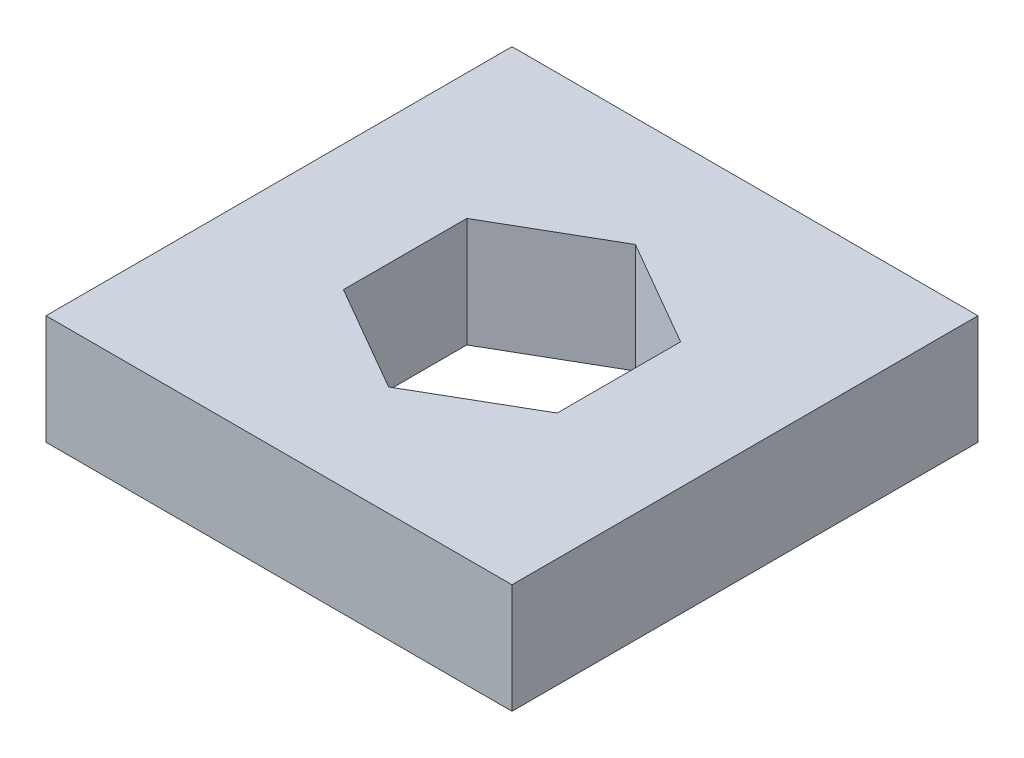
ISO-10303-21;
HEADER;
FILE_DESCRIPTION(('STEP AP214'),'2;1');
FILE_NAME('part.step','',(''),(''),'','','');
FILE_SCHEMA(('AUTOMOTIVE_DESIGN { 1 0 10303 214 1 1 1 1 }'));
ENDSEC;
DATA;
#1=APPLICATION_CONTEXT('core data for automotive mechanical design processes');
#2=APPLICATION_PROTOCOL_DEFINITION('international standard','automotive_design',2000,#1);
#3=PRODUCT_CONTEXT('',#1,'mechanical');
#4=PRODUCT('Part','Part','',(#3));
#5=PRODUCT_RELATED_PRODUCT_CATEGORY('part','',(#4));
#6=PRODUCT_DEFINITION_FORMATION('','',#4);
#7=PRODUCT_DEFINITION_CONTEXT('part definition',#1,'design');
#8=PRODUCT_DEFINITION('design','',#6,#7);
#9=PRODUCT_DEFINITION_SHAPE('','',#8);
#10=(LENGTH_UNIT() NAMED_UNIT(*) SI_UNIT(.MILLI.,.METRE.));
#11=(NAMED_UNIT(*) PLANE_ANGLE_UNIT() SI_UNIT($,.RADIAN.));
#12=(NAMED_UNIT(*) SI_UNIT($,.STERADIAN.) SOLID_ANGLE_UNIT());
#13=UNCERTAINTY_MEASURE_WITH_UNIT(LENGTH_MEASURE(1.E-05),#10,'distance_accuracy_value','');
#14=(GEOMETRIC_REPRESENTATION_CONTEXT(3) GLOBAL_UNCERTAINTY_ASSIGNED_CONTEXT((#13)) GLOBAL_UNIT_ASSIGNED_CONTEXT((#10,
#11,#12)) REPRESENTATION_CONTEXT('',''));
#15=CARTESIAN_POINT('',(0.,0.,0.));
#16=DIRECTION('',(0.,0.,1.));
#17=DIRECTION('',(1.,0.,0.));
#18=AXIS2_PLACEMENT_3D('',#15,#16,#17);
#19=CARTESIAN_POINT('',(0.,-6.35,13.4990397082405));
#20=DIRECTION('',(0.,0.,1.));
#21=DIRECTION('',(1.,0.,0.));
#22=AXIS2_PLACEMENT_3D('',#19,#20,#21);
#23=PLANE('',#22);
#24=DIRECTION('',(1.,0.,0.));
#25=VECTOR('',#24,1.);
#26=CARTESIAN_POINT('',(0.,0.,13.4990397082405));
#27=LINE('',#26,#25);
#28=CARTESIAN_POINT('',(-13.4990397082405,0.,13.4990397082405));
#29=VERTEX_POINT('',#28);
#30=CARTESIAN_POINT('',(13.4990397082405,0.,13.4990397082405));
#31=VERTEX_POINT('',#30);
#32=EDGE_CURVE('E157',#29,#31,#27,.T.);
#33=ORIENTED_EDGE('',*,*,#32,.F.);
#34=DIRECTION('',(0.,1.,0.));
#35=VECTOR('',#34,1.);
#36=CARTESIAN_POINT('',(-13.4990397082405,-6.35,13.4990397082405));
#37=LINE('',#36,#35);
#38=CARTESIAN_POINT('',(-13.4990397082405,-6.35,13.4990397082405));
#39=VERTEX_POINT('',#38);
#40=EDGE_CURVE('E11',#39,#29,#37,.T.);
#41=ORIENTED_EDGE('',*,*,#40,.F.);
#42=DIRECTION('',(1.,0.,0.));
#43=VECTOR('',#42,1.);
#44=CARTESIAN_POINT('',(0.,-6.35,13.4990397082405));
#45=LINE('',#44,#43);
#46=CARTESIAN_POINT('',(13.4990397082405,-6.35,13.4990397082405));
#47=VERTEX_POINT('',#46);
#48=EDGE_CURVE('E137',#39,#47,#45,.T.);
#49=ORIENTED_EDGE('',*,*,#48,.T.);
#50=DIRECTION('',(0.,1.,0.));
#51=VECTOR('',#50,1.);
#52=CARTESIAN_POINT('',(13.4990397082405,-6.35,13.4990397082405));
#53=LINE('',#52,#51);
#54=EDGE_CURVE('E134',#47,#31,#53,.T.);
#55=ORIENTED_EDGE('',*,*,#54,.T.);
#56=EDGE_LOOP('',(#33,#41,#49,#55));
#57=FACE_BOUND('',#56,.T.);
#58=ADVANCED_FACE('F33',(#57),#23,.T.);
#59=CARTESIAN_POINT('',(-13.4990397082405,-6.35,0.));
#60=DIRECTION('',(1.,0.,0.));
#61=DIRECTION('',(0.,0.,-1.));
#62=AXIS2_PLACEMENT_3D('',#59,#60,#61);
#63=PLANE('',#62);
#64=DIRECTION('',(0.,0.,-1.));
#65=VECTOR('',#64,1.);
#66=CARTESIAN_POINT('',(-13.4990397082405,0.,0.));
#67=LINE('',#66,#65);
#68=CARTESIAN_POINT('',(-13.4990397082405,0.,-13.4990397082405));
#69=VERTEX_POINT('',#68);
#70=EDGE_CURVE('E163',#29,#69,#67,.T.);
#71=ORIENTED_EDGE('',*,*,#70,.T.);
#72=DIRECTION('',(0.,1.,0.));
#73=VECTOR('',#72,1.);
#74=CARTESIAN_POINT('',(-13.4990397082405,-6.35,-13.4990397082405));
#75=LINE('',#74,#73);
#76=CARTESIAN_POINT('',(-13.4990397082405,-6.35,-13.4990397082405));
#77=VERTEX_POINT('',#76);
#78=EDGE_CURVE('E43',#77,#69,#75,.T.);
#79=ORIENTED_EDGE('',*,*,#78,.F.);
#80=DIRECTION('',(0.,0.,-1.));
#81=VECTOR('',#80,1.);
#82=CARTESIAN_POINT('',(-13.4990397082405,-6.35,0.));
#83=LINE('',#82,#81);
#84=EDGE_CURVE('E126',#39,#77,#83,.T.);
#85=ORIENTED_EDGE('',*,*,#84,.F.);
#86=ORIENTED_EDGE('',*,*,#40,.T.);
#87=EDGE_LOOP('',(#71,#79,#85,#86));
#88=FACE_BOUND('',#87,.T.);
#89=ADVANCED_FACE('F225',(#88),#63,.F.);
#90=CARTESIAN_POINT('',(0.,-6.35,-13.4990397082405));
#91=DIRECTION('',(0.,0.,1.));
#92=DIRECTION('',(1.,0.,0.));
#93=AXIS2_PLACEMENT_3D('',#90,#91,#92);
#94=PLANE('',#93);
#95=DIRECTION('',(1.,0.,0.));
#96=VECTOR('',#95,1.);
#97=CARTESIAN_POINT('',(0.,0.,-13.4990397082405));
#98=LINE('',#97,#96);
#99=CARTESIAN_POINT('',(13.4990397082405,0.,-13.4990397082405));
#100=VERTEX_POINT('',#99);
#101=EDGE_CURVE('E86',#69,#100,#98,.T.);
#102=ORIENTED_EDGE('',*,*,#101,.T.);
#103=DIRECTION('',(0.,1.,0.));
#104=VECTOR('',#103,1.);
#105=CARTESIAN_POINT('',(13.4990397082405,-6.35,-13.4990397082405));
#106=LINE('',#105,#104);
#107=CARTESIAN_POINT('',(13.4990397082405,-6.35,-13.4990397082405));
#108=VERTEX_POINT('',#107);
#109=EDGE_CURVE('E130',#108,#100,#106,.T.);
#110=ORIENTED_EDGE('',*,*,#109,.F.);
#111=DIRECTION('',(1.,0.,0.));
#112=VECTOR('',#111,1.);
#113=CARTESIAN_POINT('',(0.,-6.35,-13.4990397082405));
#114=LINE('',#113,#112);
#115=EDGE_CURVE('E120',#77,#108,#114,.T.);
#116=ORIENTED_EDGE('',*,*,#115,.F.);
#117=ORIENTED_EDGE('',*,*,#78,.T.);
#118=EDGE_LOOP('',(#102,#110,#116,#117));
#119=FACE_BOUND('',#118,.T.);
#120=ADVANCED_FACE('F131',(#119),#94,.F.);
#121=CARTESIAN_POINT('',(3.09562499999998,-6.35,-5.36177978118044));
#122=DIRECTION('',(0.499999999999995,0.,-0.866025403784441));
#123=DIRECTION('',(-0.866025403784442,0.,-0.499999999999995));
#124=AXIS2_PLACEMENT_3D('',#121,#122,#123);
#125=PLANE('',#124);
#126=DIRECTION('',(-0.866025403784442,0.,-0.499999999999995));
#127=VECTOR('',#126,1.);
#128=CARTESIAN_POINT('',(3.09562499999998,0.,-5.36177978118044));
#129=LINE('',#128,#127);
#130=CARTESIAN_POINT('',(6.19124999999995,0.,-3.57451985412034));
#131=VERTEX_POINT('',#130);
#132=CARTESIAN_POINT('',(0.,0.,-7.14903970824053));
#133=VERTEX_POINT('',#132);
#134=EDGE_CURVE('E144',#131,#133,#129,.T.);
#135=ORIENTED_EDGE('',*,*,#134,.T.);
#136=DIRECTION('',(0.,1.,0.));
#137=VECTOR('',#136,1.);
#138=CARTESIAN_POINT('',(0.,-6.35,-7.14903970824053));
#139=LINE('',#138,#137);
#140=CARTESIAN_POINT('',(0.,-6.35,-7.14903970824053));
#141=VERTEX_POINT('',#140);
#142=EDGE_CURVE('E168',#141,#133,#139,.T.);
#143=ORIENTED_EDGE('',*,*,#142,.F.);
#144=DIRECTION('',(-0.866025403784442,0.,-0.499999999999995));
#145=VECTOR('',#144,1.);
#146=CARTESIAN_POINT('',(3.09562499999998,-6.35,-5.36177978118044));
#147=LINE('',#146,#145);
#148=CARTESIAN_POINT('',(6.19124999999995,-6.35,-3.57451985412034));
#149=VERTEX_POINT('',#148);
#150=EDGE_CURVE('E164',#149,#141,#147,.T.);
#151=ORIENTED_EDGE('',*,*,#150,.F.);
#152=DIRECTION('',(0.,1.,0.));
#153=VECTOR('',#152,1.);
#154=CARTESIAN_POINT('',(6.19124999999995,-6.35,-3.57451985412034));
#155=LINE('',#154,#153);
#156=EDGE_CURVE('E37',#149,#131,#155,.T.);
#157=ORIENTED_EDGE('',*,*,#156,.T.);
#158=EDGE_LOOP('',(#135,#143,#151,#157));
#159=FACE_BOUND('',#158,.T.);
#160=ADVANCED_FACE('F35',(#159),#125,.F.);
#161=CARTESIAN_POINT('',(-3.095625,-6.35,-5.36177978118039));
#162=DIRECTION('',(-0.500000000000001,0.,-0.866025403784438));
#163=DIRECTION('',(-0.866025403784438,0.,0.500000000000001));
#164=AXIS2_PLACEMENT_3D('',#161,#162,#163);
#165=PLANE('',#164);
#166=DIRECTION('',(-0.866025403784438,0.,0.500000000000001));
#167=VECTOR('',#166,1.);
#168=CARTESIAN_POINT('',(-3.095625,0.,-5.36177978118039));
#169=LINE('',#168,#167);
#170=CARTESIAN_POINT('',(-6.19125,0.,-3.57451985412025));
#171=VERTEX_POINT('',#170);
#172=EDGE_CURVE('E155',#133,#171,#169,.T.);
#173=ORIENTED_EDGE('',*,*,#172,.T.);
#174=DIRECTION('',(0.,1.,0.));
#175=VECTOR('',#174,1.);
#176=CARTESIAN_POINT('',(-6.19125,-6.35,-3.57451985412025));
#177=LINE('',#176,#175);
#178=CARTESIAN_POINT('',(-6.19125,-6.35,-3.57451985412025));
#179=VERTEX_POINT('',#178);
#180=EDGE_CURVE('E171',#179,#171,#177,.T.);
#181=ORIENTED_EDGE('',*,*,#180,.F.);
#182=DIRECTION('',(-0.866025403784438,0.,0.500000000000001));
#183=VECTOR('',#182,1.);
#184=CARTESIAN_POINT('',(-3.095625,-6.35,-5.36177978118039));
#185=LINE('',#184,#183);
#186=EDGE_CURVE('E139',#141,#179,#185,.T.);
#187=ORIENTED_EDGE('',*,*,#186,.F.);
#188=ORIENTED_EDGE('',*,*,#142,.T.);
#189=EDGE_LOOP('',(#173,#181,#187,#188));
#190=FACE_BOUND('',#189,.T.);
#191=ADVANCED_FACE('F196',(#190),#165,.F.);
#192=CARTESIAN_POINT('',(-6.19124999999999,-6.35,0.));
#193=DIRECTION('',(-1.,0.,0.));
#194=DIRECTION('',(0.,0.,1.));
#195=AXIS2_PLACEMENT_3D('',#192,#193,#194);
#196=PLANE('',#195);
#197=DIRECTION('',(0.,0.,1.));
#198=VECTOR('',#197,1.);
#199=CARTESIAN_POINT('',(-6.19124999999999,0.,0.));
#200=LINE('',#199,#198);
#201=CARTESIAN_POINT('',(-6.19124999999998,0.,3.57451985412029));
#202=VERTEX_POINT('',#201);
#203=EDGE_CURVE('E153',#171,#202,#200,.T.);
#204=ORIENTED_EDGE('',*,*,#203,.T.);
#205=DIRECTION('',(0.,1.,0.));
#206=VECTOR('',#205,1.);
#207=CARTESIAN_POINT('',(-6.19124999999998,-6.35,3.57451985412029));
#208=LINE('',#207,#206);
#209=CARTESIAN_POINT('',(-6.19124999999998,-6.35,3.57451985412029));
#210=VERTEX_POINT('',#209);
#211=EDGE_CURVE('E174',#210,#202,#208,.T.);
#212=ORIENTED_EDGE('',*,*,#211,.F.);
#213=DIRECTION('',(0.,0.,1.));
#214=VECTOR('',#213,1.);
#215=CARTESIAN_POINT('',(-6.19124999999999,-6.35,0.));
#216=LINE('',#215,#214);
#217=EDGE_CURVE('E198',#179,#210,#216,.T.);
#218=ORIENTED_EDGE('',*,*,#217,.F.);
#219=ORIENTED_EDGE('',*,*,#180,.T.);
#220=EDGE_LOOP('',(#204,#212,#218,#219));
#221=FACE_BOUND('',#220,.T.);
#222=ADVANCED_FACE('F210',(#221),#196,.F.);
#223=CARTESIAN_POINT('',(-3.09562499999996,-6.35,5.36177978118041));
#224=DIRECTION('',(-0.499999999999995,0.,0.866025403784441));
#225=DIRECTION('',(0.866025403784442,0.,0.499999999999995));
#226=AXIS2_PLACEMENT_3D('',#223,#224,#225);
#227=PLANE('',#226);
#228=DIRECTION('',(0.866025403784442,0.,0.499999999999995));
#229=VECTOR('',#228,1.);
#230=CARTESIAN_POINT('',(-3.09562499999996,0.,5.36177978118041));
#231=LINE('',#230,#229);
#232=CARTESIAN_POINT('',(0.,0.,7.14903970824053));
#233=VERTEX_POINT('',#232);
#234=EDGE_CURVE('E151',#202,#233,#231,.T.);
#235=ORIENTED_EDGE('',*,*,#234,.T.);
#236=DIRECTION('',(0.,1.,0.));
#237=VECTOR('',#236,1.);
#238=CARTESIAN_POINT('',(0.,-6.35,7.14903970824053));
#239=LINE('',#238,#237);
#240=CARTESIAN_POINT('',(0.,-6.35,7.14903970824053));
#241=VERTEX_POINT('',#240);
#242=EDGE_CURVE('E177',#241,#233,#239,.T.);
#243=ORIENTED_EDGE('',*,*,#242,.F.);
#244=DIRECTION('',(0.866025403784442,0.,0.499999999999995));
#245=VECTOR('',#244,1.);
#246=CARTESIAN_POINT('',(-3.09562499999996,-6.35,5.36177978118041));
#247=LINE('',#246,#245);
#248=EDGE_CURVE('E204',#210,#241,#247,.T.);
#249=ORIENTED_EDGE('',*,*,#248,.F.);
#250=ORIENTED_EDGE('',*,*,#211,.T.);
#251=EDGE_LOOP('',(#235,#243,#249,#250));
#252=FACE_BOUND('',#251,.T.);
#253=ADVANCED_FACE('F212',(#252),#227,.F.);
#254=CARTESIAN_POINT('',(3.09562500000004,-6.35,5.36177978118037));
#255=DIRECTION('',(0.500000000000007,0.,0.866025403784435));
#256=DIRECTION('',(0.866025403784435,0.,-0.500000000000007));
#257=AXIS2_PLACEMENT_3D('',#254,#255,#256);
#258=PLANE('',#257);
#259=DIRECTION('',(0.866025403784435,0.,-0.500000000000007));
#260=VECTOR('',#259,1.);
#261=CARTESIAN_POINT('',(3.09562500000004,0.,5.36177978118037));
#262=LINE('',#261,#260);
#263=CARTESIAN_POINT('',(6.19125000000003,0.,3.57451985412021));
#264=VERTEX_POINT('',#263);
#265=EDGE_CURVE('E149',#233,#264,#262,.T.);
#266=ORIENTED_EDGE('',*,*,#265,.T.);
#267=DIRECTION('',(0.,1.,0.));
#268=VECTOR('',#267,1.);
#269=CARTESIAN_POINT('',(6.19125000000003,-6.35,3.57451985412021));
#270=LINE('',#269,#268);
#271=CARTESIAN_POINT('',(6.19125000000003,-6.35,3.57451985412021));
#272=VERTEX_POINT('',#271);
#273=EDGE_CURVE('E179',#272,#264,#270,.T.);
#274=ORIENTED_EDGE('',*,*,#273,.F.);
#275=DIRECTION('',(0.866025403784435,0.,-0.500000000000007));
#276=VECTOR('',#275,1.);
#277=CARTESIAN_POINT('',(3.09562500000004,-6.35,5.36177978118037));
#278=LINE('',#277,#276);
#279=EDGE_CURVE('E200',#241,#272,#278,.T.);
#280=ORIENTED_EDGE('',*,*,#279,.F.);
#281=ORIENTED_EDGE('',*,*,#242,.T.);
#282=EDGE_LOOP('',(#266,#274,#280,#281));
#283=FACE_BOUND('',#282,.T.);
#284=ADVANCED_FACE('F215',(#283),#258,.F.);
#285=CARTESIAN_POINT('',(6.19124999999999,-6.35,0.));
#286=DIRECTION('',(1.,0.,0.));
#287=DIRECTION('',(0.,0.,-1.));
#288=AXIS2_PLACEMENT_3D('',#285,#286,#287);
#289=PLANE('',#288);
#290=DIRECTION('',(0.,0.,-1.));
#291=VECTOR('',#290,1.);
#292=CARTESIAN_POINT('',(6.19124999999999,0.,0.));
#293=LINE('',#292,#291);
#294=EDGE_CURVE('E147',#264,#131,#293,.T.);
#295=ORIENTED_EDGE('',*,*,#294,.T.);
#296=ORIENTED_EDGE('',*,*,#156,.F.);
#297=DIRECTION('',(0.,0.,-1.));
#298=VECTOR('',#297,1.);
#299=CARTESIAN_POINT('',(6.19124999999999,-6.35,0.));
#300=LINE('',#299,#298);
#301=EDGE_CURVE('E98',#272,#149,#300,.T.);
#302=ORIENTED_EDGE('',*,*,#301,.F.);
#303=ORIENTED_EDGE('',*,*,#273,.T.);
#304=EDGE_LOOP('',(#295,#296,#302,#303));
#305=FACE_BOUND('',#304,.T.);
#306=ADVANCED_FACE('F216',(#305),#289,.F.);
#307=CARTESIAN_POINT('',(13.4990397082405,-6.35,0.));
#308=DIRECTION('',(1.,0.,0.));
#309=DIRECTION('',(0.,0.,-1.));
#310=AXIS2_PLACEMENT_3D('',#307,#308,#309);
#311=PLANE('',#310);
#312=DIRECTION('',(0.,0.,-1.));
#313=VECTOR('',#312,1.);
#314=CARTESIAN_POINT('',(13.4990397082405,0.,0.));
#315=LINE('',#314,#313);
#316=EDGE_CURVE('E160',#31,#100,#315,.T.);
#317=ORIENTED_EDGE('',*,*,#316,.F.);
#318=ORIENTED_EDGE('',*,*,#54,.F.);
#319=DIRECTION('',(0.,0.,-1.));
#320=VECTOR('',#319,1.);
#321=CARTESIAN_POINT('',(13.4990397082405,-6.35,0.));
#322=LINE('',#321,#320);
#323=EDGE_CURVE('E125',#47,#108,#322,.T.);
#324=ORIENTED_EDGE('',*,*,#323,.T.);
#325=ORIENTED_EDGE('',*,*,#109,.T.);
#326=EDGE_LOOP('',(#317,#318,#324,#325));
#327=FACE_BOUND('',#326,.T.);
#328=ADVANCED_FACE('F136',(#327),#311,.T.);
#329=CARTESIAN_POINT('',(0.,-6.35,0.));
#330=DIRECTION('',(0.,1.,0.));
#331=DIRECTION('',(0.,0.,1.));
#332=AXIS2_PLACEMENT_3D('',#329,#330,#331);
#333=PLANE('',#332);
#334=ORIENTED_EDGE('',*,*,#150,.T.);
#335=ORIENTED_EDGE('',*,*,#186,.T.);
#336=ORIENTED_EDGE('',*,*,#217,.T.);
#337=ORIENTED_EDGE('',*,*,#248,.T.);
#338=ORIENTED_EDGE('',*,*,#279,.T.);
#339=ORIENTED_EDGE('',*,*,#301,.T.);
#340=EDGE_LOOP('',(#334,#335,#336,#337,#338,#339));
#341=FACE_BOUND('',#340,.T.);
#342=ORIENTED_EDGE('',*,*,#48,.F.);
#343=ORIENTED_EDGE('',*,*,#84,.T.);
#344=ORIENTED_EDGE('',*,*,#115,.T.);
#345=ORIENTED_EDGE('',*,*,#323,.F.);
#346=EDGE_LOOP('',(#342,#343,#344,#345));
#347=FACE_BOUND('',#346,.T.);
#348=ADVANCED_FACE('F123',(#341,#347),#333,.F.);
#349=CARTESIAN_POINT('',(0.,0.,0.));
#350=DIRECTION('',(0.,1.,0.));
#351=DIRECTION('',(0.,0.,1.));
#352=AXIS2_PLACEMENT_3D('',#349,#350,#351);
#353=PLANE('',#352);
#354=ORIENTED_EDGE('',*,*,#134,.F.);
#355=ORIENTED_EDGE('',*,*,#294,.F.);
#356=ORIENTED_EDGE('',*,*,#265,.F.);
#357=ORIENTED_EDGE('',*,*,#234,.F.);
#358=ORIENTED_EDGE('',*,*,#203,.F.);
#359=ORIENTED_EDGE('',*,*,#172,.F.);
#360=EDGE_LOOP('',(#354,#355,#356,#357,#358,#359));
#361=FACE_BOUND('',#360,.T.);
#362=ORIENTED_EDGE('',*,*,#32,.T.);
#363=ORIENTED_EDGE('',*,*,#316,.T.);
#364=ORIENTED_EDGE('',*,*,#101,.F.);
#365=ORIENTED_EDGE('',*,*,#70,.F.);
#366=EDGE_LOOP('',(#362,#363,#364,#365));
#367=FACE_BOUND('',#366,.T.);
#368=ADVANCED_FACE('F190',(#361,#367),#353,.T.);
#369=CLOSED_SHELL('',(#58,#89,#120,#160,#191,#222,#253,#284,#306,#328,#348,#368));
#370=MANIFOLD_SOLID_BREP('B2',#369);
#371=ADVANCED_BREP_SHAPE_REPRESENTATION('',(#18,#370),#14);
#372=SHAPE_DEFINITION_REPRESENTATION(#9,#371);
ENDSEC;
END-ISO-10303-21;
